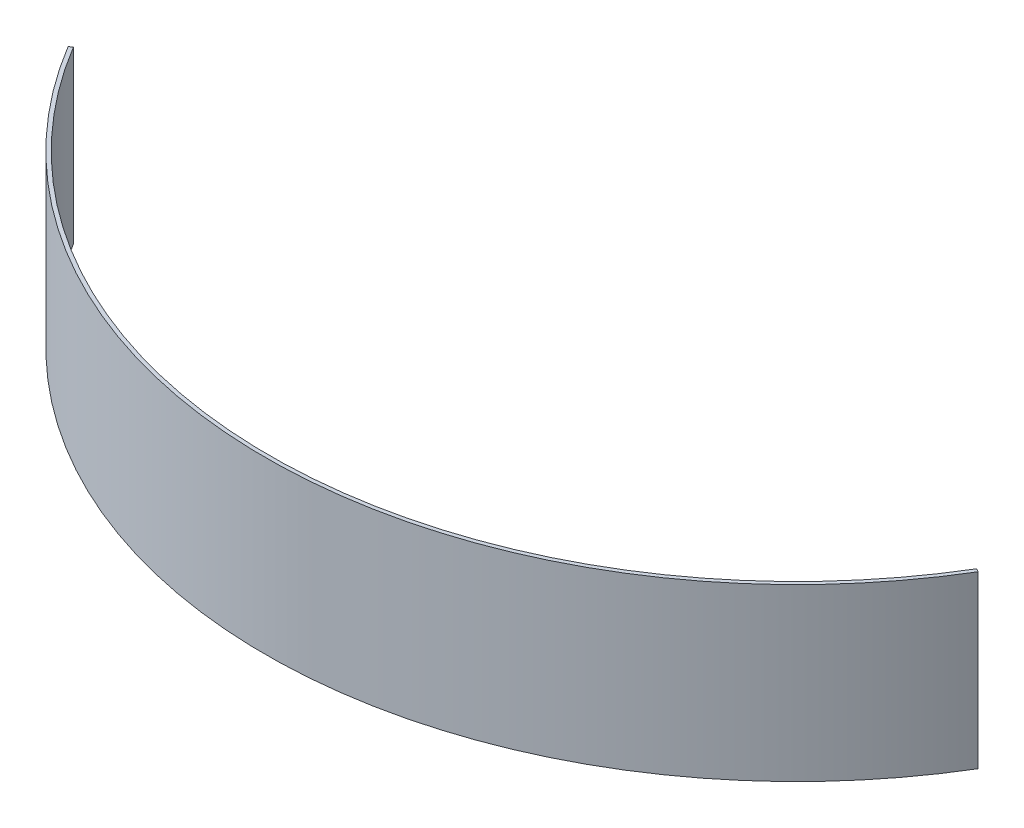
ISO-10303-21;
HEADER;
FILE_DESCRIPTION(('STEP AP214'),'2;1');
FILE_NAME('part.step','',(''),(''),'','','');
FILE_SCHEMA(('AUTOMOTIVE_DESIGN { 1 0 10303 214 1 1 1 1 }'));
ENDSEC;
DATA;
#1=APPLICATION_CONTEXT('core data for automotive mechanical design processes');
#2=APPLICATION_PROTOCOL_DEFINITION('international standard','automotive_design',2000,#1);
#3=PRODUCT_CONTEXT('',#1,'mechanical');
#4=PRODUCT('Part','Part','',(#3));
#5=PRODUCT_RELATED_PRODUCT_CATEGORY('part','',(#4));
#6=PRODUCT_DEFINITION_FORMATION('','',#4);
#7=PRODUCT_DEFINITION_CONTEXT('part definition',#1,'design');
#8=PRODUCT_DEFINITION('design','',#6,#7);
#9=PRODUCT_DEFINITION_SHAPE('','',#8);
#10=(LENGTH_UNIT() NAMED_UNIT(*) SI_UNIT(.MILLI.,.METRE.));
#11=(NAMED_UNIT(*) PLANE_ANGLE_UNIT() SI_UNIT($,.RADIAN.));
#12=(NAMED_UNIT(*) SI_UNIT($,.STERADIAN.) SOLID_ANGLE_UNIT());
#13=UNCERTAINTY_MEASURE_WITH_UNIT(LENGTH_MEASURE(1.E-05),#10,'distance_accuracy_value','');
#14=(GEOMETRIC_REPRESENTATION_CONTEXT(3) GLOBAL_UNCERTAINTY_ASSIGNED_CONTEXT((#13)) GLOBAL_UNIT_ASSIGNED_CONTEXT((#10,
#11,#12)) REPRESENTATION_CONTEXT('',''));
#15=CARTESIAN_POINT('',(0.,0.,0.));
#16=DIRECTION('',(0.,0.,1.));
#17=DIRECTION('',(1.,0.,0.));
#18=AXIS2_PLACEMENT_3D('',#15,#16,#17);
#19=CARTESIAN_POINT('',(0.,57.15,-91.5810023967853));
#20=DIRECTION('',(0.,-1.,0.));
#21=DIRECTION('',(0.,0.,-1.));
#22=AXIS2_PLACEMENT_3D('',#19,#20,#21);
#23=CYLINDRICAL_SURFACE('',#22,177.8);
#24=CARTESIAN_POINT('',(0.,0.,-91.5810023967853));
#25=DIRECTION('',(0.,1.,0.));
#26=DIRECTION('',(0.,0.,1.));
#27=AXIS2_PLACEMENT_3D('',#24,#25,#26);
#28=CIRCLE('',#27,177.8);
#29=CARTESIAN_POINT('',(-152.4,0.,0.));
#30=VERTEX_POINT('',#29);
#31=CARTESIAN_POINT('',(152.4,0.,0.));
#32=VERTEX_POINT('',#31);
#33=EDGE_CURVE('E95',#30,#32,#28,.T.);
#34=ORIENTED_EDGE('',*,*,#33,.T.);
#35=DIRECTION('',(0.,-1.,0.));
#36=VECTOR('',#35,1.);
#37=CARTESIAN_POINT('',(152.4,57.15,0.));
#38=LINE('',#37,#36);
#39=CARTESIAN_POINT('',(152.4,57.15,0.));
#40=VERTEX_POINT('',#39);
#41=EDGE_CURVE('E11',#40,#32,#38,.T.);
#42=ORIENTED_EDGE('',*,*,#41,.F.);
#43=CARTESIAN_POINT('',(0.,57.15,-91.5810023967853));
#44=DIRECTION('',(0.,1.,0.));
#45=DIRECTION('',(0.,0.,1.));
#46=AXIS2_PLACEMENT_3D('',#43,#44,#45);
#47=CIRCLE('',#46,177.8);
#48=CARTESIAN_POINT('',(-152.4,57.15,0.));
#49=VERTEX_POINT('',#48);
#50=EDGE_CURVE('E72',#49,#40,#47,.T.);
#51=ORIENTED_EDGE('',*,*,#50,.F.);
#52=DIRECTION('',(0.,-1.,0.));
#53=VECTOR('',#52,1.);
#54=CARTESIAN_POINT('',(-152.4,57.15,0.));
#55=LINE('',#54,#53);
#56=EDGE_CURVE('E48',#49,#30,#55,.T.);
#57=ORIENTED_EDGE('',*,*,#56,.T.);
#58=EDGE_LOOP('',(#34,#42,#51,#57));
#59=FACE_BOUND('',#58,.T.);
#60=ADVANCED_FACE('F32',(#59),#23,.T.);
#61=CARTESIAN_POINT('',(151.311428571429,57.15,-0.654150017119895));
#62=DIRECTION('',(0.515078753637701,0.,-0.857142857142864));
#63=DIRECTION('',(-0.857142857142864,0.,-0.515078753637701));
#64=AXIS2_PLACEMENT_3D('',#61,#62,#63);
#65=PLANE('',#64);
#66=DIRECTION('',(0.857142857142864,0.,0.515078753637701));
#67=VECTOR('',#66,1.);
#68=CARTESIAN_POINT('',(151.311428571429,0.,-0.654150017119895));
#69=LINE('',#68,#67);
#70=CARTESIAN_POINT('',(151.311428571429,0.,-0.654150017119895));
#71=VERTEX_POINT('',#70);
#72=EDGE_CURVE('E81',#71,#32,#69,.T.);
#73=ORIENTED_EDGE('',*,*,#72,.F.);
#74=DIRECTION('',(0.,-1.,0.));
#75=VECTOR('',#74,1.);
#76=CARTESIAN_POINT('',(151.311428571429,57.15,-0.654150017119895));
#77=LINE('',#76,#75);
#78=CARTESIAN_POINT('',(151.311428571429,57.15,-0.654150017119895));
#79=VERTEX_POINT('',#78);
#80=EDGE_CURVE('E40',#79,#71,#77,.T.);
#81=ORIENTED_EDGE('',*,*,#80,.F.);
#82=DIRECTION('',(0.857142857142864,0.,0.515078753637701));
#83=VECTOR('',#82,1.);
#84=CARTESIAN_POINT('',(151.311428571429,57.15,-0.654150017119895));
#85=LINE('',#84,#83);
#86=EDGE_CURVE('E79',#79,#40,#85,.T.);
#87=ORIENTED_EDGE('',*,*,#86,.T.);
#88=ORIENTED_EDGE('',*,*,#41,.T.);
#89=EDGE_LOOP('',(#73,#81,#87,#88));
#90=FACE_BOUND('',#89,.T.);
#91=ADVANCED_FACE('F78',(#90),#65,.T.);
#92=CARTESIAN_POINT('',(0.,57.15,-91.5810023967853));
#93=DIRECTION('',(0.,-1.,0.));
#94=DIRECTION('',(0.,0.,-1.));
#95=AXIS2_PLACEMENT_3D('',#92,#93,#94);
#96=CYLINDRICAL_SURFACE('',#95,176.53);
#97=CARTESIAN_POINT('',(0.,0.,-91.5810023967853));
#98=DIRECTION('',(0.,1.,0.));
#99=DIRECTION('',(1.,0.,0.));
#100=AXIS2_PLACEMENT_3D('',#97,#98,#99);
#101=CIRCLE('',#100,176.53);
#102=CARTESIAN_POINT('',(-151.311428571429,0.,-0.654150017120006));
#103=VERTEX_POINT('',#102);
#104=EDGE_CURVE('E98',#103,#71,#101,.T.);
#105=ORIENTED_EDGE('',*,*,#104,.F.);
#106=DIRECTION('',(0.,-1.,0.));
#107=VECTOR('',#106,1.);
#108=CARTESIAN_POINT('',(-151.311428571429,57.15,-0.654150017120006));
#109=LINE('',#108,#107);
#110=CARTESIAN_POINT('',(-151.311428571429,57.15,-0.654150017120006));
#111=VERTEX_POINT('',#110);
#112=EDGE_CURVE('E61',#111,#103,#109,.T.);
#113=ORIENTED_EDGE('',*,*,#112,.F.);
#114=CARTESIAN_POINT('',(0.,57.15,-91.5810023967853));
#115=DIRECTION('',(0.,1.,0.));
#116=DIRECTION('',(1.,0.,0.));
#117=AXIS2_PLACEMENT_3D('',#114,#115,#116);
#118=CIRCLE('',#117,176.53);
#119=EDGE_CURVE('E87',#111,#79,#118,.T.);
#120=ORIENTED_EDGE('',*,*,#119,.T.);
#121=ORIENTED_EDGE('',*,*,#80,.T.);
#122=EDGE_LOOP('',(#105,#113,#120,#121));
#123=FACE_BOUND('',#122,.T.);
#124=ADVANCED_FACE('F89',(#123),#96,.F.);
#125=CARTESIAN_POINT('',(-152.4,57.15,0.));
#126=DIRECTION('',(-0.515078753637761,0.,-0.857142857142829));
#127=DIRECTION('',(-0.857142857142829,0.,0.515078753637761));
#128=AXIS2_PLACEMENT_3D('',#125,#126,#127);
#129=PLANE('',#128);
#130=DIRECTION('',(0.857142857142828,0.,-0.51507875363776));
#131=VECTOR('',#130,1.);
#132=CARTESIAN_POINT('',(-152.4,0.,0.));
#133=LINE('',#132,#131);
#134=EDGE_CURVE('E100',#30,#103,#133,.T.);
#135=ORIENTED_EDGE('',*,*,#134,.F.);
#136=ORIENTED_EDGE('',*,*,#56,.F.);
#137=DIRECTION('',(0.857142857142828,0.,-0.51507875363776));
#138=VECTOR('',#137,1.);
#139=CARTESIAN_POINT('',(-152.4,57.15,0.));
#140=LINE('',#139,#138);
#141=EDGE_CURVE('E90',#49,#111,#140,.T.);
#142=ORIENTED_EDGE('',*,*,#141,.T.);
#143=ORIENTED_EDGE('',*,*,#112,.T.);
#144=EDGE_LOOP('',(#135,#136,#142,#143));
#145=FACE_BOUND('',#144,.T.);
#146=ADVANCED_FACE('F106',(#145),#129,.T.);
#147=CARTESIAN_POINT('',(0.,57.15,-91.5810023967853));
#148=DIRECTION('',(0.,1.,0.));
#149=DIRECTION('',(0.,0.,1.));
#150=AXIS2_PLACEMENT_3D('',#147,#148,#149);
#151=PLANE('',#150);
#152=ORIENTED_EDGE('',*,*,#50,.T.);
#153=ORIENTED_EDGE('',*,*,#86,.F.);
#154=ORIENTED_EDGE('',*,*,#119,.F.);
#155=ORIENTED_EDGE('',*,*,#141,.F.);
#156=EDGE_LOOP('',(#152,#153,#154,#155));
#157=FACE_BOUND('',#156,.T.);
#158=ADVANCED_FACE('F86',(#157),#151,.T.);
#159=CARTESIAN_POINT('',(0.,0.,-91.5810023967853));
#160=DIRECTION('',(0.,1.,0.));
#161=DIRECTION('',(0.,0.,1.));
#162=AXIS2_PLACEMENT_3D('',#159,#160,#161);
#163=PLANE('',#162);
#164=ORIENTED_EDGE('',*,*,#33,.F.);
#165=ORIENTED_EDGE('',*,*,#134,.T.);
#166=ORIENTED_EDGE('',*,*,#104,.T.);
#167=ORIENTED_EDGE('',*,*,#72,.T.);
#168=EDGE_LOOP('',(#164,#165,#166,#167));
#169=FACE_BOUND('',#168,.T.);
#170=ADVANCED_FACE('F105',(#169),#163,.F.);
#171=CLOSED_SHELL('',(#60,#91,#124,#146,#158,#170));
#172=MANIFOLD_SOLID_BREP('B2',#171);
#173=ADVANCED_BREP_SHAPE_REPRESENTATION('',(#18,#172),#14);
#174=SHAPE_DEFINITION_REPRESENTATION(#9,#173);
ENDSEC;
END-ISO-10303-21;
